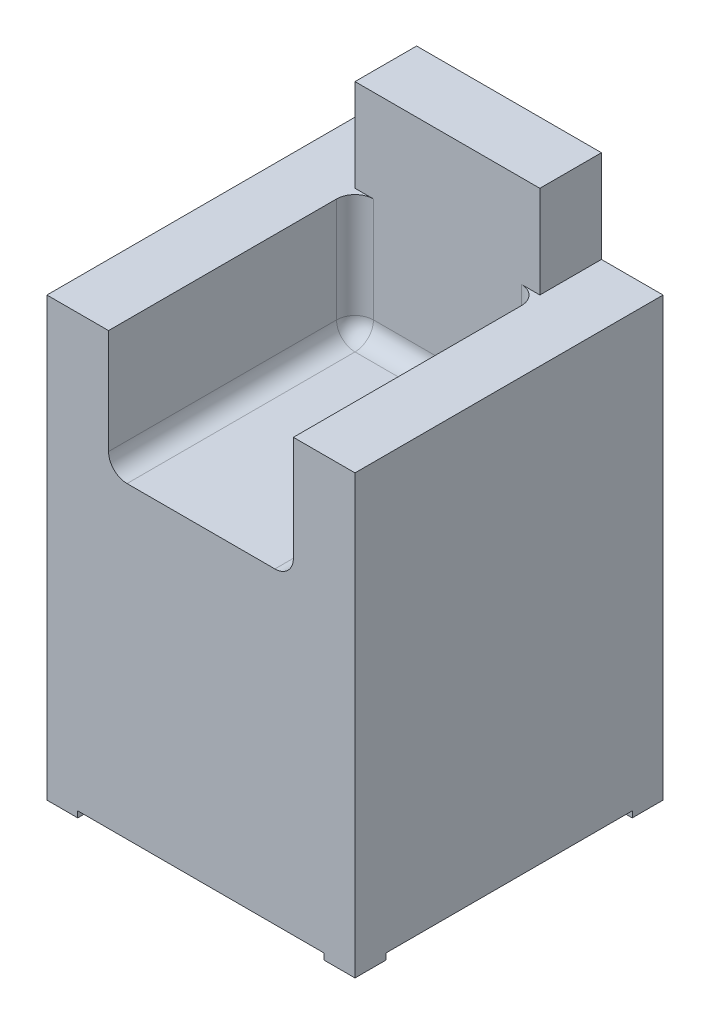
ISO-10303-21;
HEADER;
FILE_DESCRIPTION(('STEP AP214'),'2;1');
FILE_NAME('part.step','',(''),(''),'','','');
FILE_SCHEMA(('AUTOMOTIVE_DESIGN { 1 0 10303 214 1 1 1 1 }'));
ENDSEC;
DATA;
#1=APPLICATION_CONTEXT('core data for automotive mechanical design processes');
#2=APPLICATION_PROTOCOL_DEFINITION('international standard','automotive_design',2000,#1);
#3=PRODUCT_CONTEXT('',#1,'mechanical');
#4=PRODUCT('Part','Part','',(#3));
#5=PRODUCT_RELATED_PRODUCT_CATEGORY('part','',(#4));
#6=PRODUCT_DEFINITION_FORMATION('','',#4);
#7=PRODUCT_DEFINITION_CONTEXT('part definition',#1,'design');
#8=PRODUCT_DEFINITION('design','',#6,#7);
#9=PRODUCT_DEFINITION_SHAPE('','',#8);
#10=(LENGTH_UNIT() NAMED_UNIT(*) SI_UNIT(.MILLI.,.METRE.));
#11=(NAMED_UNIT(*) PLANE_ANGLE_UNIT() SI_UNIT($,.RADIAN.));
#12=(NAMED_UNIT(*) SI_UNIT($,.STERADIAN.) SOLID_ANGLE_UNIT());
#13=UNCERTAINTY_MEASURE_WITH_UNIT(LENGTH_MEASURE(1.E-05),#10,'distance_accuracy_value','');
#14=(GEOMETRIC_REPRESENTATION_CONTEXT(3) GLOBAL_UNCERTAINTY_ASSIGNED_CONTEXT((#13)) GLOBAL_UNIT_ASSIGNED_CONTEXT((#10,
#11,#12)) REPRESENTATION_CONTEXT('',''));
#15=CARTESIAN_POINT('',(0.,0.,0.));
#16=DIRECTION('',(0.,0.,1.));
#17=DIRECTION('',(1.,0.,0.));
#18=AXIS2_PLACEMENT_3D('',#15,#16,#17);
#19=CARTESIAN_POINT('',(0.,-250.,0.));
#20=DIRECTION('',(0.,1.,0.));
#21=DIRECTION('',(0.,0.,1.));
#22=AXIS2_PLACEMENT_3D('',#19,#20,#21);
#23=PLANE('',#22);
#24=DIRECTION('',(0.,0.,-1.));
#25=VECTOR('',#24,1.);
#26=CARTESIAN_POINT('',(-50.,-250.,50.));
#27=LINE('',#26,#25);
#28=CARTESIAN_POINT('',(-50.,-250.,50.));
#29=VERTEX_POINT('',#28);
#30=CARTESIAN_POINT('',(-50.,-250.,0.));
#31=VERTEX_POINT('',#30);
#32=EDGE_CURVE('E60',#29,#31,#27,.T.);
#33=ORIENTED_EDGE('',*,*,#32,.F.);
#34=DIRECTION('',(-1.,0.,0.));
#35=VECTOR('',#34,1.);
#36=CARTESIAN_POINT('',(0.,-250.,50.0000000000001));
#37=LINE('',#36,#35);
#38=CARTESIAN_POINT('',(0.,-250.,50.0000000000001));
#39=VERTEX_POINT('',#38);
#40=EDGE_CURVE('E233',#39,#29,#37,.T.);
#41=ORIENTED_EDGE('',*,*,#40,.F.);
#42=DIRECTION('',(0.,0.,-1.));
#43=VECTOR('',#42,1.);
#44=CARTESIAN_POINT('',(0.,-250.,500.));
#45=LINE('',#44,#43);
#46=CARTESIAN_POINT('',(0.,-250.,450.));
#47=VERTEX_POINT('',#46);
#48=EDGE_CURVE('E375',#47,#39,#45,.T.);
#49=ORIENTED_EDGE('',*,*,#48,.F.);
#50=DIRECTION('',(1.,0.,0.));
#51=VECTOR('',#50,1.);
#52=CARTESIAN_POINT('',(-50.,-250.,450.));
#53=LINE('',#52,#51);
#54=CARTESIAN_POINT('',(-50.,-250.,450.));
#55=VERTEX_POINT('',#54);
#56=EDGE_CURVE('E291',#55,#47,#53,.T.);
#57=ORIENTED_EDGE('',*,*,#56,.F.);
#58=DIRECTION('',(0.,0.,-1.));
#59=VECTOR('',#58,1.);
#60=CARTESIAN_POINT('',(-50.,-250.,500.));
#61=LINE('',#60,#59);
#62=CARTESIAN_POINT('',(-50.,-250.,500.));
#63=VERTEX_POINT('',#62);
#64=EDGE_CURVE('E289',#63,#55,#61,.T.);
#65=ORIENTED_EDGE('',*,*,#64,.F.);
#66=DIRECTION('',(1.,0.,0.));
#67=VECTOR('',#66,1.);
#68=CARTESIAN_POINT('',(-500.,-250.,500.));
#69=LINE('',#68,#67);
#70=CARTESIAN_POINT('',(-450.,-250.,500.));
#71=VERTEX_POINT('',#70);
#72=EDGE_CURVE('E380',#71,#63,#69,.T.);
#73=ORIENTED_EDGE('',*,*,#72,.F.);
#74=DIRECTION('',(0.,0.,1.));
#75=VECTOR('',#74,1.);
#76=CARTESIAN_POINT('',(-450.,-250.,450.));
#77=LINE('',#76,#75);
#78=CARTESIAN_POINT('',(-450.,-250.,450.));
#79=VERTEX_POINT('',#78);
#80=EDGE_CURVE('E295',#79,#71,#77,.T.);
#81=ORIENTED_EDGE('',*,*,#80,.F.);
#82=DIRECTION('',(1.,0.,0.));
#83=VECTOR('',#82,1.);
#84=CARTESIAN_POINT('',(-500.,-250.,450.));
#85=LINE('',#84,#83);
#86=CARTESIAN_POINT('',(-500.,-250.,450.));
#87=VERTEX_POINT('',#86);
#88=EDGE_CURVE('E308',#87,#79,#85,.T.);
#89=ORIENTED_EDGE('',*,*,#88,.F.);
#90=DIRECTION('',(0.,0.,1.));
#91=VECTOR('',#90,1.);
#92=CARTESIAN_POINT('',(-500.,-250.,0.));
#93=LINE('',#92,#91);
#94=CARTESIAN_POINT('',(-500.,-250.,50.0000000000001));
#95=VERTEX_POINT('',#94);
#96=EDGE_CURVE('E383',#95,#87,#93,.T.);
#97=ORIENTED_EDGE('',*,*,#96,.F.);
#98=DIRECTION('',(-1.,0.,0.));
#99=VECTOR('',#98,1.);
#100=CARTESIAN_POINT('',(-450.,-250.,50.0000000000001));
#101=LINE('',#100,#99);
#102=CARTESIAN_POINT('',(-450.,-250.,50.0000000000001));
#103=VERTEX_POINT('',#102);
#104=EDGE_CURVE('E68',#103,#95,#101,.T.);
#105=ORIENTED_EDGE('',*,*,#104,.F.);
#106=DIRECTION('',(0.,0.,1.));
#107=VECTOR('',#106,1.);
#108=CARTESIAN_POINT('',(-450.,-250.,0.));
#109=LINE('',#108,#107);
#110=CARTESIAN_POINT('',(-450.,-250.,0.));
#111=VERTEX_POINT('',#110);
#112=EDGE_CURVE('E269',#111,#103,#109,.T.);
#113=ORIENTED_EDGE('',*,*,#112,.F.);
#114=DIRECTION('',(-1.,0.,0.));
#115=VECTOR('',#114,1.);
#116=CARTESIAN_POINT('',(0.,-250.,0.));
#117=LINE('',#116,#115);
#118=EDGE_CURVE('E251',#31,#111,#117,.T.);
#119=ORIENTED_EDGE('',*,*,#118,.F.);
#120=EDGE_LOOP('',(#33,#41,#49,#57,#65,#73,#81,#89,#97,#105,#113,#119));
#121=FACE_BOUND('',#120,.T.);
#122=ADVANCED_FACE('F43',(#121),#23,.F.);
#123=CARTESIAN_POINT('',(0.,250.,0.));
#124=DIRECTION('',(0.,1.,0.));
#125=DIRECTION('',(0.,0.,1.));
#126=AXIS2_PLACEMENT_3D('',#123,#124,#125);
#127=PLANE('',#126);
#128=DIRECTION('',(0.,0.,1.));
#129=VECTOR('',#128,1.);
#130=CARTESIAN_POINT('',(-130.,250.,0.));
#131=LINE('',#130,#129);
#132=CARTESIAN_POINT('',(-130.,250.,500.));
#133=VERTEX_POINT('',#132);
#134=CARTESIAN_POINT('',(-130.,250.,130.));
#135=VERTEX_POINT('',#134);
#136=EDGE_CURVE('E411',#133,#135,#131,.F.);
#137=ORIENTED_EDGE('',*,*,#136,.T.);
#138=DIRECTION('',(1.,0.,0.));
#139=VECTOR('',#138,1.);
#140=CARTESIAN_POINT('',(0.,250.,130.));
#141=LINE('',#140,#139);
#142=CARTESIAN_POINT('',(-370.,250.,130.));
#143=VERTEX_POINT('',#142);
#144=EDGE_CURVE('E437',#135,#143,#141,.F.);
#145=ORIENTED_EDGE('',*,*,#144,.T.);
#146=DIRECTION('',(0.,0.,-1.));
#147=VECTOR('',#146,1.);
#148=CARTESIAN_POINT('',(-370.,250.,0.));
#149=LINE('',#148,#147);
#150=CARTESIAN_POINT('',(-370.,250.,500.));
#151=VERTEX_POINT('',#150);
#152=EDGE_CURVE('E405',#143,#151,#149,.F.);
#153=ORIENTED_EDGE('',*,*,#152,.T.);
#154=DIRECTION('',(1.,0.,0.));
#155=VECTOR('',#154,1.);
#156=CARTESIAN_POINT('',(-500.,250.,500.));
#157=LINE('',#156,#155);
#158=EDGE_CURVE('E376',#151,#133,#157,.T.);
#159=ORIENTED_EDGE('',*,*,#158,.T.);
#160=EDGE_LOOP('',(#137,#145,#153,#159));
#161=FACE_BOUND('',#160,.T.);
#162=ADVANCED_FACE('F523',(#161),#127,.T.);
#163=CARTESIAN_POINT('',(-500.,600.,100.));
#164=DIRECTION('',(0.,0.,-1.));
#165=DIRECTION('',(-1.,0.,0.));
#166=AXIS2_PLACEMENT_3D('',#163,#164,#165);
#167=PLANE('',#166);
#168=DIRECTION('',(0.,1.,0.));
#169=VECTOR('',#168,1.);
#170=CARTESIAN_POINT('',(-400.,600.,100.));
#171=LINE('',#170,#169);
#172=CARTESIAN_POINT('',(-400.,450.,100.));
#173=VERTEX_POINT('',#172);
#174=CARTESIAN_POINT('',(-400.,600.,100.));
#175=VERTEX_POINT('',#174);
#176=EDGE_CURVE('E338',#173,#175,#171,.T.);
#177=ORIENTED_EDGE('',*,*,#176,.F.);
#178=DIRECTION('',(1.,0.,0.));
#179=VECTOR('',#178,1.);
#180=CARTESIAN_POINT('',(-500.,450.,100.));
#181=LINE('',#180,#179);
#182=CARTESIAN_POINT('',(-370.,450.,100.));
#183=VERTEX_POINT('',#182);
#184=EDGE_CURVE('E426',#173,#183,#181,.T.);
#185=ORIENTED_EDGE('',*,*,#184,.T.);
#186=DIRECTION('',(0.,-1.,0.));
#187=VECTOR('',#186,1.);
#188=CARTESIAN_POINT('',(-370.,280.,100.));
#189=LINE('',#188,#187);
#190=CARTESIAN_POINT('',(-370.,280.,100.));
#191=VERTEX_POINT('',#190);
#192=EDGE_CURVE('E421',#183,#191,#189,.T.);
#193=ORIENTED_EDGE('',*,*,#192,.T.);
#194=DIRECTION('',(1.,0.,0.));
#195=VECTOR('',#194,1.);
#196=CARTESIAN_POINT('',(-500.,280.,100.));
#197=LINE('',#196,#195);
#198=CARTESIAN_POINT('',(-130.,280.,100.));
#199=VERTEX_POINT('',#198);
#200=EDGE_CURVE('E416',#191,#199,#197,.T.);
#201=ORIENTED_EDGE('',*,*,#200,.T.);
#202=DIRECTION('',(0.,-1.,0.));
#203=VECTOR('',#202,1.);
#204=CARTESIAN_POINT('',(-130.,450.,100.));
#205=LINE('',#204,#203);
#206=CARTESIAN_POINT('',(-130.,450.,100.));
#207=VERTEX_POINT('',#206);
#208=EDGE_CURVE('E418',#199,#207,#205,.F.);
#209=ORIENTED_EDGE('',*,*,#208,.T.);
#210=DIRECTION('',(1.,0.,0.));
#211=VECTOR('',#210,1.);
#212=CARTESIAN_POINT('',(-500.,450.,100.));
#213=LINE('',#212,#211);
#214=CARTESIAN_POINT('',(-100.,450.,100.));
#215=VERTEX_POINT('',#214);
#216=EDGE_CURVE('E424',#207,#215,#213,.T.);
#217=ORIENTED_EDGE('',*,*,#216,.T.);
#218=DIRECTION('',(0.,-1.,0.));
#219=VECTOR('',#218,1.);
#220=CARTESIAN_POINT('',(-100.,600.,100.));
#221=LINE('',#220,#219);
#222=CARTESIAN_POINT('',(-100.,600.,100.));
#223=VERTEX_POINT('',#222);
#224=EDGE_CURVE('E329',#223,#215,#221,.T.);
#225=ORIENTED_EDGE('',*,*,#224,.F.);
#226=DIRECTION('',(1.,0.,0.));
#227=VECTOR('',#226,1.);
#228=CARTESIAN_POINT('',(-500.,600.,100.));
#229=LINE('',#228,#227);
#230=EDGE_CURVE('E372',#175,#223,#229,.T.);
#231=ORIENTED_EDGE('',*,*,#230,.F.);
#232=EDGE_LOOP('',(#177,#185,#193,#201,#209,#217,#225,#231));
#233=FACE_BOUND('',#232,.T.);
#234=ADVANCED_FACE('F460',(#233),#167,.F.);
#235=CARTESIAN_POINT('',(0.,250.,500.));
#236=DIRECTION('',(-1.,0.,0.));
#237=DIRECTION('',(0.,0.,1.));
#238=AXIS2_PLACEMENT_3D('',#235,#236,#237);
#239=PLANE('',#238);
#240=DIRECTION('',(0.,-1.,0.));
#241=VECTOR('',#240,1.);
#242=CARTESIAN_POINT('',(0.,250.,0.));
#243=LINE('',#242,#241);
#244=CARTESIAN_POINT('',(0.,450.,0.));
#245=VERTEX_POINT('',#244);
#246=CARTESIAN_POINT('',(0.,-260.,0.));
#247=VERTEX_POINT('',#246);
#248=EDGE_CURVE('E392',#245,#247,#243,.T.);
#249=ORIENTED_EDGE('',*,*,#248,.F.);
#250=DIRECTION('',(0.,0.,-1.));
#251=VECTOR('',#250,1.);
#252=CARTESIAN_POINT('',(0.,450.,500.));
#253=LINE('',#252,#251);
#254=CARTESIAN_POINT('',(0.,450.,500.));
#255=VERTEX_POINT('',#254);
#256=EDGE_CURVE('E349',#255,#245,#253,.T.);
#257=ORIENTED_EDGE('',*,*,#256,.F.);
#258=DIRECTION('',(0.,-1.,0.));
#259=VECTOR('',#258,1.);
#260=CARTESIAN_POINT('',(0.,250.,500.));
#261=LINE('',#260,#259);
#262=CARTESIAN_POINT('',(0.,-260.,500.));
#263=VERTEX_POINT('',#262);
#264=EDGE_CURVE('E379',#255,#263,#261,.T.);
#265=ORIENTED_EDGE('',*,*,#264,.T.);
#266=DIRECTION('',(0.,0.,1.));
#267=VECTOR('',#266,1.);
#268=CARTESIAN_POINT('',(0.,-260.,450.));
#269=LINE('',#268,#267);
#270=CARTESIAN_POINT('',(0.,-260.,450.));
#271=VERTEX_POINT('',#270);
#272=EDGE_CURVE('E299',#271,#263,#269,.T.);
#273=ORIENTED_EDGE('',*,*,#272,.F.);
#274=DIRECTION('',(0.,1.,0.));
#275=VECTOR('',#274,1.);
#276=CARTESIAN_POINT('',(0.,-260.,450.));
#277=LINE('',#276,#275);
#278=EDGE_CURVE('E273',#271,#47,#277,.T.);
#279=ORIENTED_EDGE('',*,*,#278,.T.);
#280=ORIENTED_EDGE('',*,*,#48,.T.);
#281=DIRECTION('',(0.,1.,0.));
#282=VECTOR('',#281,1.);
#283=CARTESIAN_POINT('',(0.,-260.,50.0000000000001));
#284=LINE('',#283,#282);
#285=CARTESIAN_POINT('',(0.,-260.,50.0000000000001));
#286=VERTEX_POINT('',#285);
#287=EDGE_CURVE('E239',#286,#39,#284,.T.);
#288=ORIENTED_EDGE('',*,*,#287,.F.);
#289=DIRECTION('',(0.,0.,1.));
#290=VECTOR('',#289,1.);
#291=CARTESIAN_POINT('',(0.,-260.,0.));
#292=LINE('',#291,#290);
#293=EDGE_CURVE('E258',#247,#286,#292,.T.);
#294=ORIENTED_EDGE('',*,*,#293,.F.);
#295=EDGE_LOOP('',(#249,#257,#265,#273,#279,#280,#288,#294));
#296=FACE_BOUND('',#295,.T.);
#297=ADVANCED_FACE('F562',(#296),#239,.F.);
#298=CARTESIAN_POINT('',(0.,250.,0.));
#299=DIRECTION('',(0.,0.,1.));
#300=DIRECTION('',(1.,0.,0.));
#301=AXIS2_PLACEMENT_3D('',#298,#299,#300);
#302=PLANE('',#301);
#303=DIRECTION('',(-1.,0.,0.));
#304=VECTOR('',#303,1.);
#305=CARTESIAN_POINT('',(0.,600.,0.));
#306=LINE('',#305,#304);
#307=CARTESIAN_POINT('',(-100.,600.,0.));
#308=VERTEX_POINT('',#307);
#309=CARTESIAN_POINT('',(-400.,600.,0.));
#310=VERTEX_POINT('',#309);
#311=EDGE_CURVE('E370',#308,#310,#306,.T.);
#312=ORIENTED_EDGE('',*,*,#311,.F.);
#313=DIRECTION('',(0.,-1.,0.));
#314=VECTOR('',#313,1.);
#315=CARTESIAN_POINT('',(-100.,250.,0.));
#316=LINE('',#315,#314);
#317=CARTESIAN_POINT('',(-100.,450.,0.));
#318=VERTEX_POINT('',#317);
#319=EDGE_CURVE('E335',#308,#318,#316,.T.);
#320=ORIENTED_EDGE('',*,*,#319,.T.);
#321=DIRECTION('',(1.,0.,0.));
#322=VECTOR('',#321,1.);
#323=CARTESIAN_POINT('',(0.,450.,0.));
#324=LINE('',#323,#322);
#325=EDGE_CURVE('E399',#318,#245,#324,.T.);
#326=ORIENTED_EDGE('',*,*,#325,.T.);
#327=ORIENTED_EDGE('',*,*,#248,.T.);
#328=DIRECTION('',(1.,0.,0.));
#329=VECTOR('',#328,1.);
#330=CARTESIAN_POINT('',(-50.,-260.,0.));
#331=LINE('',#330,#329);
#332=CARTESIAN_POINT('',(-50.,-260.,0.));
#333=VERTEX_POINT('',#332);
#334=EDGE_CURVE('E260',#333,#247,#331,.T.);
#335=ORIENTED_EDGE('',*,*,#334,.F.);
#336=DIRECTION('',(0.,1.,0.));
#337=VECTOR('',#336,1.);
#338=CARTESIAN_POINT('',(-50.,-260.,0.));
#339=LINE('',#338,#337);
#340=EDGE_CURVE('E896',#333,#31,#339,.T.);
#341=ORIENTED_EDGE('',*,*,#340,.T.);
#342=ORIENTED_EDGE('',*,*,#118,.T.);
#343=DIRECTION('',(0.,1.,0.));
#344=VECTOR('',#343,1.);
#345=CARTESIAN_POINT('',(-450.,-260.,0.));
#346=LINE('',#345,#344);
#347=CARTESIAN_POINT('',(-450.,-260.,0.));
#348=VERTEX_POINT('',#347);
#349=EDGE_CURVE('E254',#348,#111,#346,.T.);
#350=ORIENTED_EDGE('',*,*,#349,.F.);
#351=DIRECTION('',(1.,0.,0.));
#352=VECTOR('',#351,1.);
#353=CARTESIAN_POINT('',(-500.,-260.,0.));
#354=LINE('',#353,#352);
#355=CARTESIAN_POINT('',(-500.,-260.,0.));
#356=VERTEX_POINT('',#355);
#357=EDGE_CURVE('E275',#356,#348,#354,.T.);
#358=ORIENTED_EDGE('',*,*,#357,.F.);
#359=DIRECTION('',(0.,-1.,0.));
#360=VECTOR('',#359,1.);
#361=CARTESIAN_POINT('',(-500.,250.,0.));
#362=LINE('',#361,#360);
#363=CARTESIAN_POINT('',(-500.,450.,0.));
#364=VERTEX_POINT('',#363);
#365=EDGE_CURVE('E390',#364,#356,#362,.T.);
#366=ORIENTED_EDGE('',*,*,#365,.F.);
#367=DIRECTION('',(1.,0.,0.));
#368=VECTOR('',#367,1.);
#369=CARTESIAN_POINT('',(0.,450.,0.));
#370=LINE('',#369,#368);
#371=CARTESIAN_POINT('',(-400.,450.,0.));
#372=VERTEX_POINT('',#371);
#373=EDGE_CURVE('E346',#364,#372,#370,.T.);
#374=ORIENTED_EDGE('',*,*,#373,.T.);
#375=DIRECTION('',(0.,1.,0.));
#376=VECTOR('',#375,1.);
#377=CARTESIAN_POINT('',(-400.,250.,0.));
#378=LINE('',#377,#376);
#379=EDGE_CURVE('E343',#372,#310,#378,.T.);
#380=ORIENTED_EDGE('',*,*,#379,.T.);
#381=EDGE_LOOP('',(#312,#320,#326,#327,#335,#341,#342,#350,#358,#366,#374,#380));
#382=FACE_BOUND('',#381,.T.);
#383=ADVANCED_FACE('F493',(#382),#302,.F.);
#384=CARTESIAN_POINT('',(-500.,250.,0.));
#385=DIRECTION('',(1.,0.,0.));
#386=DIRECTION('',(0.,0.,-1.));
#387=AXIS2_PLACEMENT_3D('',#384,#385,#386);
#388=PLANE('',#387);
#389=DIRECTION('',(0.,0.,1.));
#390=VECTOR('',#389,1.);
#391=CARTESIAN_POINT('',(-500.,450.,100.));
#392=LINE('',#391,#390);
#393=CARTESIAN_POINT('',(-500.,450.,500.));
#394=VERTEX_POINT('',#393);
#395=EDGE_CURVE('E359',#364,#394,#392,.T.);
#396=ORIENTED_EDGE('',*,*,#395,.F.);
#397=ORIENTED_EDGE('',*,*,#365,.T.);
#398=DIRECTION('',(0.,0.,-1.));
#399=VECTOR('',#398,1.);
#400=CARTESIAN_POINT('',(-500.,-260.,50.0000000000001));
#401=LINE('',#400,#399);
#402=CARTESIAN_POINT('',(-500.,-260.,50.0000000000001));
#403=VERTEX_POINT('',#402);
#404=EDGE_CURVE('E277',#403,#356,#401,.T.);
#405=ORIENTED_EDGE('',*,*,#404,.F.);
#406=DIRECTION('',(0.,1.,0.));
#407=VECTOR('',#406,1.);
#408=CARTESIAN_POINT('',(-500.,-260.,50.0000000000001));
#409=LINE('',#408,#407);
#410=EDGE_CURVE('E252',#403,#95,#409,.T.);
#411=ORIENTED_EDGE('',*,*,#410,.T.);
#412=ORIENTED_EDGE('',*,*,#96,.T.);
#413=DIRECTION('',(0.,1.,0.));
#414=VECTOR('',#413,1.);
#415=CARTESIAN_POINT('',(-500.,-260.,450.));
#416=LINE('',#415,#414);
#417=CARTESIAN_POINT('',(-500.,-260.,450.));
#418=VERTEX_POINT('',#417);
#419=EDGE_CURVE('E322',#418,#87,#416,.T.);
#420=ORIENTED_EDGE('',*,*,#419,.F.);
#421=DIRECTION('',(0.,0.,-1.));
#422=VECTOR('',#421,1.);
#423=CARTESIAN_POINT('',(-500.,-260.,500.));
#424=LINE('',#423,#422);
#425=CARTESIAN_POINT('',(-500.,-260.,500.));
#426=VERTEX_POINT('',#425);
#427=EDGE_CURVE('E311',#426,#418,#424,.T.);
#428=ORIENTED_EDGE('',*,*,#427,.F.);
#429=DIRECTION('',(0.,-1.,0.));
#430=VECTOR('',#429,1.);
#431=CARTESIAN_POINT('',(-500.,250.,500.));
#432=LINE('',#431,#430);
#433=EDGE_CURVE('E388',#394,#426,#432,.T.);
#434=ORIENTED_EDGE('',*,*,#433,.F.);
#435=EDGE_LOOP('',(#396,#397,#405,#411,#412,#420,#428,#434));
#436=FACE_BOUND('',#435,.T.);
#437=ADVANCED_FACE('F497',(#436),#388,.F.);
#438=CARTESIAN_POINT('',(-500.,250.,500.));
#439=DIRECTION('',(0.,0.,-1.));
#440=DIRECTION('',(-1.,0.,0.));
#441=AXIS2_PLACEMENT_3D('',#438,#439,#440);
#442=PLANE('',#441);
#443=ORIENTED_EDGE('',*,*,#433,.T.);
#444=DIRECTION('',(-1.,0.,0.));
#445=VECTOR('',#444,1.);
#446=CARTESIAN_POINT('',(-450.,-260.,500.));
#447=LINE('',#446,#445);
#448=CARTESIAN_POINT('',(-450.,-260.,500.));
#449=VERTEX_POINT('',#448);
#450=EDGE_CURVE('E307',#449,#426,#447,.T.);
#451=ORIENTED_EDGE('',*,*,#450,.F.);
#452=DIRECTION('',(0.,1.,0.));
#453=VECTOR('',#452,1.);
#454=CARTESIAN_POINT('',(-450.,-260.,500.));
#455=LINE('',#454,#453);
#456=EDGE_CURVE('E325',#449,#71,#455,.T.);
#457=ORIENTED_EDGE('',*,*,#456,.T.);
#458=ORIENTED_EDGE('',*,*,#72,.T.);
#459=DIRECTION('',(0.,1.,0.));
#460=VECTOR('',#459,1.);
#461=CARTESIAN_POINT('',(-50.,-260.,500.));
#462=LINE('',#461,#460);
#463=CARTESIAN_POINT('',(-50.,-260.,500.));
#464=VERTEX_POINT('',#463);
#465=EDGE_CURVE('E283',#464,#63,#462,.T.);
#466=ORIENTED_EDGE('',*,*,#465,.F.);
#467=DIRECTION('',(-1.,0.,0.));
#468=VECTOR('',#467,1.);
#469=CARTESIAN_POINT('',(0.,-260.,500.));
#470=LINE('',#469,#468);
#471=EDGE_CURVE('E297',#263,#464,#470,.T.);
#472=ORIENTED_EDGE('',*,*,#471,.F.);
#473=ORIENTED_EDGE('',*,*,#264,.F.);
#474=DIRECTION('',(1.,0.,0.));
#475=VECTOR('',#474,1.);
#476=CARTESIAN_POINT('',(-100.,450.,500.));
#477=LINE('',#476,#475);
#478=CARTESIAN_POINT('',(-100.,450.,500.));
#479=VERTEX_POINT('',#478);
#480=EDGE_CURVE('E353',#479,#255,#477,.T.);
#481=ORIENTED_EDGE('',*,*,#480,.F.);
#482=DIRECTION('',(0.,-1.,0.));
#483=VECTOR('',#482,1.);
#484=CARTESIAN_POINT('',(-100.,450.,500.));
#485=LINE('',#484,#483);
#486=CARTESIAN_POINT('',(-100.,280.,500.));
#487=VERTEX_POINT('',#486);
#488=EDGE_CURVE('E356',#479,#487,#485,.T.);
#489=ORIENTED_EDGE('',*,*,#488,.T.);
#490=CARTESIAN_POINT('',(-130.,280.,500.));
#491=DIRECTION('',(0.,0.,-1.));
#492=DIRECTION('',(-1.,0.,0.));
#493=AXIS2_PLACEMENT_3D('',#490,#491,#492);
#494=CIRCLE('',#493,30.);
#495=EDGE_CURVE('E414',#487,#133,#494,.T.);
#496=ORIENTED_EDGE('',*,*,#495,.T.);
#497=ORIENTED_EDGE('',*,*,#158,.F.);
#498=CARTESIAN_POINT('',(-370.,280.,500.));
#499=DIRECTION('',(0.,0.,-1.));
#500=DIRECTION('',(-1.,0.,0.));
#501=AXIS2_PLACEMENT_3D('',#498,#499,#500);
#502=CIRCLE('',#501,30.);
#503=CARTESIAN_POINT('',(-400.,280.,500.));
#504=VERTEX_POINT('',#503);
#505=EDGE_CURVE('E407',#151,#504,#502,.T.);
#506=ORIENTED_EDGE('',*,*,#505,.T.);
#507=DIRECTION('',(0.,-1.,0.));
#508=VECTOR('',#507,1.);
#509=CARTESIAN_POINT('',(-400.,450.,500.));
#510=LINE('',#509,#508);
#511=CARTESIAN_POINT('',(-400.,450.,500.));
#512=VERTEX_POINT('',#511);
#513=EDGE_CURVE('E367',#512,#504,#510,.T.);
#514=ORIENTED_EDGE('',*,*,#513,.F.);
#515=DIRECTION('',(1.,0.,0.));
#516=VECTOR('',#515,1.);
#517=CARTESIAN_POINT('',(-500.,450.,500.));
#518=LINE('',#517,#516);
#519=EDGE_CURVE('E362',#394,#512,#518,.T.);
#520=ORIENTED_EDGE('',*,*,#519,.F.);
#521=EDGE_LOOP('',(#443,#451,#457,#458,#466,#472,#473,#481,#489,#496,#497,#506,#514,#520));
#522=FACE_BOUND('',#521,.T.);
#523=ADVANCED_FACE('F517',(#522),#442,.F.);
#524=CARTESIAN_POINT('',(0.,600.,0.));
#525=DIRECTION('',(0.,1.,0.));
#526=DIRECTION('',(0.,0.,1.));
#527=AXIS2_PLACEMENT_3D('',#524,#525,#526);
#528=PLANE('',#527);
#529=DIRECTION('',(0.,0.,1.));
#530=VECTOR('',#529,1.);
#531=CARTESIAN_POINT('',(-100.,600.,0.));
#532=LINE('',#531,#530);
#533=EDGE_CURVE('E397',#308,#223,#532,.T.);
#534=ORIENTED_EDGE('',*,*,#533,.F.);
#535=ORIENTED_EDGE('',*,*,#311,.T.);
#536=DIRECTION('',(0.,0.,-1.));
#537=VECTOR('',#536,1.);
#538=CARTESIAN_POINT('',(-400.,600.,0.));
#539=LINE('',#538,#537);
#540=EDGE_CURVE('E394',#175,#310,#539,.T.);
#541=ORIENTED_EDGE('',*,*,#540,.F.);
#542=ORIENTED_EDGE('',*,*,#230,.T.);
#543=EDGE_LOOP('',(#534,#535,#541,#542));
#544=FACE_BOUND('',#543,.T.);
#545=ADVANCED_FACE('F541',(#544),#528,.T.);
#546=CARTESIAN_POINT('',(-400.,450.,500.));
#547=DIRECTION('',(-1.,0.,0.));
#548=DIRECTION('',(0.,0.,1.));
#549=AXIS2_PLACEMENT_3D('',#546,#547,#548);
#550=PLANE('',#549);
#551=DIRECTION('',(0.,0.,-1.));
#552=VECTOR('',#551,1.);
#553=CARTESIAN_POINT('',(-400.,280.,500.));
#554=LINE('',#553,#552);
#555=CARTESIAN_POINT('',(-400.,280.,130.));
#556=VERTEX_POINT('',#555);
#557=EDGE_CURVE('E402',#504,#556,#554,.T.);
#558=ORIENTED_EDGE('',*,*,#557,.T.);
#559=DIRECTION('',(0.,-1.,0.));
#560=VECTOR('',#559,1.);
#561=CARTESIAN_POINT('',(-400.,450.,130.));
#562=LINE('',#561,#560);
#563=CARTESIAN_POINT('',(-400.,450.,130.));
#564=VERTEX_POINT('',#563);
#565=EDGE_CURVE('E429',#556,#564,#562,.F.);
#566=ORIENTED_EDGE('',*,*,#565,.T.);
#567=DIRECTION('',(0.,0.,-1.));
#568=VECTOR('',#567,1.);
#569=CARTESIAN_POINT('',(-400.,450.,500.));
#570=LINE('',#569,#568);
#571=EDGE_CURVE('E364',#512,#564,#570,.T.);
#572=ORIENTED_EDGE('',*,*,#571,.F.);
#573=ORIENTED_EDGE('',*,*,#513,.T.);
#574=EDGE_LOOP('',(#558,#566,#572,#573));
#575=FACE_BOUND('',#574,.T.);
#576=ADVANCED_FACE('F476',(#575),#550,.F.);
#577=CARTESIAN_POINT('',(0.,450.,0.));
#578=DIRECTION('',(0.,1.,0.));
#579=DIRECTION('',(0.,0.,1.));
#580=AXIS2_PLACEMENT_3D('',#577,#578,#579);
#581=PLANE('',#580);
#582=ORIENTED_EDGE('',*,*,#571,.T.);
#583=CARTESIAN_POINT('',(-370.,450.,130.));
#584=DIRECTION('',(0.,1.,0.));
#585=DIRECTION('',(0.,0.,1.));
#586=AXIS2_PLACEMENT_3D('',#583,#584,#585);
#587=CIRCLE('',#586,30.);
#588=EDGE_CURVE('E52',#564,#183,#587,.F.);
#589=ORIENTED_EDGE('',*,*,#588,.T.);
#590=ORIENTED_EDGE('',*,*,#184,.F.);
#591=DIRECTION('',(0.,0.,1.));
#592=VECTOR('',#591,1.);
#593=CARTESIAN_POINT('',(-400.,450.,-99.9999999999999));
#594=LINE('',#593,#592);
#595=EDGE_CURVE('E340',#372,#173,#594,.T.);
#596=ORIENTED_EDGE('',*,*,#595,.F.);
#597=ORIENTED_EDGE('',*,*,#373,.F.);
#598=ORIENTED_EDGE('',*,*,#395,.T.);
#599=ORIENTED_EDGE('',*,*,#519,.T.);
#600=EDGE_LOOP('',(#582,#589,#590,#596,#597,#598,#599));
#601=FACE_BOUND('',#600,.T.);
#602=ADVANCED_FACE('F483',(#601),#581,.T.);
#603=CARTESIAN_POINT('',(-100.,450.,100.));
#604=DIRECTION('',(1.,0.,0.));
#605=DIRECTION('',(0.,0.,-1.));
#606=AXIS2_PLACEMENT_3D('',#603,#604,#605);
#607=PLANE('',#606);
#608=DIRECTION('',(0.,0.,1.));
#609=VECTOR('',#608,1.);
#610=CARTESIAN_POINT('',(-100.,450.,100.));
#611=LINE('',#610,#609);
#612=CARTESIAN_POINT('',(-100.,450.,130.));
#613=VERTEX_POINT('',#612);
#614=EDGE_CURVE('E351',#613,#479,#611,.T.);
#615=ORIENTED_EDGE('',*,*,#614,.F.);
#616=DIRECTION('',(0.,-1.,0.));
#617=VECTOR('',#616,1.);
#618=CARTESIAN_POINT('',(-100.,280.,130.));
#619=LINE('',#618,#617);
#620=CARTESIAN_POINT('',(-100.,280.,130.));
#621=VERTEX_POINT('',#620);
#622=EDGE_CURVE('E433',#613,#621,#619,.T.);
#623=ORIENTED_EDGE('',*,*,#622,.T.);
#624=DIRECTION('',(0.,0.,1.));
#625=VECTOR('',#624,1.);
#626=CARTESIAN_POINT('',(-100.,280.,100.));
#627=LINE('',#626,#625);
#628=EDGE_CURVE('E409',#621,#487,#627,.T.);
#629=ORIENTED_EDGE('',*,*,#628,.T.);
#630=ORIENTED_EDGE('',*,*,#488,.F.);
#631=EDGE_LOOP('',(#615,#623,#629,#630));
#632=FACE_BOUND('',#631,.T.);
#633=ADVANCED_FACE('F530',(#632),#607,.F.);
#634=CARTESIAN_POINT('',(0.,450.,0.));
#635=DIRECTION('',(0.,1.,0.));
#636=DIRECTION('',(0.,0.,1.));
#637=AXIS2_PLACEMENT_3D('',#634,#635,#636);
#638=PLANE('',#637);
#639=ORIENTED_EDGE('',*,*,#256,.T.);
#640=ORIENTED_EDGE('',*,*,#325,.F.);
#641=DIRECTION('',(0.,0.,1.));
#642=VECTOR('',#641,1.);
#643=CARTESIAN_POINT('',(-100.,450.,-99.9999999999999));
#644=LINE('',#643,#642);
#645=EDGE_CURVE('E332',#318,#215,#644,.T.);
#646=ORIENTED_EDGE('',*,*,#645,.T.);
#647=ORIENTED_EDGE('',*,*,#216,.F.);
#648=CARTESIAN_POINT('',(-130.,450.,130.));
#649=DIRECTION('',(0.,1.,0.));
#650=DIRECTION('',(0.,0.,1.));
#651=AXIS2_PLACEMENT_3D('',#648,#649,#650);
#652=CIRCLE('',#651,30.);
#653=EDGE_CURVE('E11',#207,#613,#652,.F.);
#654=ORIENTED_EDGE('',*,*,#653,.T.);
#655=ORIENTED_EDGE('',*,*,#614,.T.);
#656=ORIENTED_EDGE('',*,*,#480,.T.);
#657=EDGE_LOOP('',(#639,#640,#646,#647,#654,#655,#656));
#658=FACE_BOUND('',#657,.T.);
#659=ADVANCED_FACE('F533',(#658),#638,.T.);
#660=CARTESIAN_POINT('',(-400.,600.,-99.9999999999999));
#661=DIRECTION('',(1.,0.,0.));
#662=DIRECTION('',(0.,0.,-1.));
#663=AXIS2_PLACEMENT_3D('',#660,#661,#662);
#664=PLANE('',#663);
#665=ORIENTED_EDGE('',*,*,#595,.T.);
#666=ORIENTED_EDGE('',*,*,#176,.T.);
#667=ORIENTED_EDGE('',*,*,#540,.T.);
#668=ORIENTED_EDGE('',*,*,#379,.F.);
#669=EDGE_LOOP('',(#665,#666,#667,#668));
#670=FACE_BOUND('',#669,.T.);
#671=ADVANCED_FACE('F488',(#670),#664,.F.);
#672=CARTESIAN_POINT('',(-100.,600.,-99.9999999999999));
#673=DIRECTION('',(-1.,0.,0.));
#674=DIRECTION('',(0.,-1.,0.));
#675=AXIS2_PLACEMENT_3D('',#672,#673,#674);
#676=PLANE('',#675);
#677=ORIENTED_EDGE('',*,*,#533,.T.);
#678=ORIENTED_EDGE('',*,*,#224,.T.);
#679=ORIENTED_EDGE('',*,*,#645,.F.);
#680=ORIENTED_EDGE('',*,*,#319,.F.);
#681=EDGE_LOOP('',(#677,#678,#679,#680));
#682=FACE_BOUND('',#681,.T.);
#683=ADVANCED_FACE('F537',(#682),#676,.F.);
#684=CARTESIAN_POINT('',(-370.,280.,500.));
#685=DIRECTION('',(0.,0.,-1.));
#686=DIRECTION('',(-1.,0.,0.));
#687=AXIS2_PLACEMENT_3D('',#684,#685,#686);
#688=CYLINDRICAL_SURFACE('',#687,30.);
#689=ORIENTED_EDGE('',*,*,#152,.F.);
#690=CARTESIAN_POINT('',(-370.,280.,130.));
#691=DIRECTION('',(0.,0.,-1.));
#692=DIRECTION('',(-1.,0.,0.));
#693=AXIS2_PLACEMENT_3D('',#690,#691,#692);
#694=CIRCLE('',#693,30.);
#695=EDGE_CURVE('E431',#143,#556,#694,.T.);
#696=ORIENTED_EDGE('',*,*,#695,.T.);
#697=ORIENTED_EDGE('',*,*,#557,.F.);
#698=ORIENTED_EDGE('',*,*,#505,.F.);
#699=EDGE_LOOP('',(#689,#696,#697,#698));
#700=FACE_BOUND('',#699,.T.);
#701=ADVANCED_FACE('F472',(#700),#688,.F.);
#702=CARTESIAN_POINT('',(-130.,280.,100.));
#703=DIRECTION('',(0.,0.,1.));
#704=DIRECTION('',(1.,0.,0.));
#705=AXIS2_PLACEMENT_3D('',#702,#703,#704);
#706=CYLINDRICAL_SURFACE('',#705,30.);
#707=ORIENTED_EDGE('',*,*,#628,.F.);
#708=CARTESIAN_POINT('',(-130.,280.,130.));
#709=DIRECTION('',(0.,0.,1.));
#710=DIRECTION('',(1.,0.,0.));
#711=AXIS2_PLACEMENT_3D('',#708,#709,#710);
#712=CIRCLE('',#711,30.);
#713=EDGE_CURVE('E435',#621,#135,#712,.F.);
#714=ORIENTED_EDGE('',*,*,#713,.T.);
#715=ORIENTED_EDGE('',*,*,#136,.F.);
#716=ORIENTED_EDGE('',*,*,#495,.F.);
#717=EDGE_LOOP('',(#707,#714,#715,#716));
#718=FACE_BOUND('',#717,.T.);
#719=ADVANCED_FACE('F526',(#718),#706,.F.);
#720=CARTESIAN_POINT('',(-130.,450.,130.));
#721=DIRECTION('',(0.,1.,0.));
#722=DIRECTION('',(0.,0.,1.));
#723=AXIS2_PLACEMENT_3D('',#720,#721,#722);
#724=CYLINDRICAL_SURFACE('',#723,30.);
#725=CARTESIAN_POINT('',(-130.,280.,130.));
#726=DIRECTION('',(0.,1.,0.));
#727=DIRECTION('',(0.,0.,1.));
#728=AXIS2_PLACEMENT_3D('',#725,#726,#727);
#729=CIRCLE('',#728,30.);
#730=EDGE_CURVE('E47',#621,#199,#729,.T.);
#731=ORIENTED_EDGE('',*,*,#730,.F.);
#732=ORIENTED_EDGE('',*,*,#622,.F.);
#733=ORIENTED_EDGE('',*,*,#653,.F.);
#734=ORIENTED_EDGE('',*,*,#208,.F.);
#735=EDGE_LOOP('',(#731,#732,#733,#734));
#736=FACE_BOUND('',#735,.T.);
#737=ADVANCED_FACE('F45',(#736),#724,.F.);
#738=CARTESIAN_POINT('',(-130.,280.,130.));
#739=DIRECTION('',(0.,0.,-1.));
#740=DIRECTION('',(-1.,0.,0.));
#741=AXIS2_PLACEMENT_3D('',#738,#739,#740);
#742=SPHERICAL_SURFACE('',#741,30.);
#743=ORIENTED_EDGE('',*,*,#713,.F.);
#744=ORIENTED_EDGE('',*,*,#730,.T.);
#745=CARTESIAN_POINT('',(-130.,280.,130.));
#746=DIRECTION('',(1.,0.,0.));
#747=DIRECTION('',(0.,0.,-1.));
#748=AXIS2_PLACEMENT_3D('',#745,#746,#747);
#749=CIRCLE('',#748,30.);
#750=EDGE_CURVE('E443',#135,#199,#749,.T.);
#751=ORIENTED_EDGE('',*,*,#750,.F.);
#752=EDGE_LOOP('',(#743,#744,#751));
#753=FACE_BOUND('',#752,.T.);
#754=ADVANCED_FACE('F453',(#753),#742,.F.);
#755=CARTESIAN_POINT('',(-500.,280.,130.));
#756=DIRECTION('',(1.,0.,0.));
#757=DIRECTION('',(0.,0.,-1.));
#758=AXIS2_PLACEMENT_3D('',#755,#756,#757);
#759=CYLINDRICAL_SURFACE('',#758,30.);
#760=CARTESIAN_POINT('',(-370.,280.,130.));
#761=DIRECTION('',(1.,0.,0.));
#762=DIRECTION('',(0.,0.,-1.));
#763=AXIS2_PLACEMENT_3D('',#760,#761,#762);
#764=CIRCLE('',#763,30.);
#765=EDGE_CURVE('E441',#143,#191,#764,.T.);
#766=ORIENTED_EDGE('',*,*,#765,.F.);
#767=ORIENTED_EDGE('',*,*,#144,.F.);
#768=ORIENTED_EDGE('',*,*,#750,.T.);
#769=ORIENTED_EDGE('',*,*,#200,.F.);
#770=EDGE_LOOP('',(#766,#767,#768,#769));
#771=FACE_BOUND('',#770,.T.);
#772=ADVANCED_FACE('F464',(#771),#759,.F.);
#773=CARTESIAN_POINT('',(-370.,280.,130.));
#774=DIRECTION('',(0.,0.,-1.));
#775=DIRECTION('',(-1.,0.,0.));
#776=AXIS2_PLACEMENT_3D('',#773,#774,#775);
#777=SPHERICAL_SURFACE('',#776,30.);
#778=ORIENTED_EDGE('',*,*,#695,.F.);
#779=ORIENTED_EDGE('',*,*,#765,.T.);
#780=CARTESIAN_POINT('',(-370.,280.,130.));
#781=DIRECTION('',(0.,-1.,0.));
#782=DIRECTION('',(0.,0.,-1.));
#783=AXIS2_PLACEMENT_3D('',#780,#781,#782);
#784=CIRCLE('',#783,30.);
#785=EDGE_CURVE('E328',#556,#191,#784,.T.);
#786=ORIENTED_EDGE('',*,*,#785,.F.);
#787=EDGE_LOOP('',(#778,#779,#786));
#788=FACE_BOUND('',#787,.T.);
#789=ADVANCED_FACE('F468',(#788),#777,.F.);
#790=CARTESIAN_POINT('',(-370.,600.,130.));
#791=DIRECTION('',(0.,1.,0.));
#792=DIRECTION('',(0.,0.,1.));
#793=AXIS2_PLACEMENT_3D('',#790,#791,#792);
#794=CYLINDRICAL_SURFACE('',#793,30.);
#795=ORIENTED_EDGE('',*,*,#588,.F.);
#796=ORIENTED_EDGE('',*,*,#565,.F.);
#797=ORIENTED_EDGE('',*,*,#785,.T.);
#798=ORIENTED_EDGE('',*,*,#192,.F.);
#799=EDGE_LOOP('',(#795,#796,#797,#798));
#800=FACE_BOUND('',#799,.T.);
#801=ADVANCED_FACE('F481',(#800),#794,.F.);
#802=CARTESIAN_POINT('',(-450.,-260.,450.));
#803=DIRECTION('',(-1.,0.,0.));
#804=DIRECTION('',(0.,0.,1.));
#805=AXIS2_PLACEMENT_3D('',#802,#803,#804);
#806=PLANE('',#805);
#807=ORIENTED_EDGE('',*,*,#80,.T.);
#808=ORIENTED_EDGE('',*,*,#456,.F.);
#809=DIRECTION('',(0.,0.,1.));
#810=VECTOR('',#809,1.);
#811=CARTESIAN_POINT('',(-450.,-260.,450.));
#812=LINE('',#811,#810);
#813=CARTESIAN_POINT('',(-450.,-260.,450.));
#814=VERTEX_POINT('',#813);
#815=EDGE_CURVE('E304',#814,#449,#812,.T.);
#816=ORIENTED_EDGE('',*,*,#815,.F.);
#817=DIRECTION('',(0.,1.,0.));
#818=VECTOR('',#817,1.);
#819=CARTESIAN_POINT('',(-450.,-260.,450.));
#820=LINE('',#819,#818);
#821=EDGE_CURVE('E315',#814,#79,#820,.T.);
#822=ORIENTED_EDGE('',*,*,#821,.T.);
#823=EDGE_LOOP('',(#807,#808,#816,#822));
#824=FACE_BOUND('',#823,.T.);
#825=ADVANCED_FACE('F572',(#824),#806,.F.);
#826=CARTESIAN_POINT('',(-500.,-260.,450.));
#827=DIRECTION('',(0.,0.,1.));
#828=DIRECTION('',(1.,0.,0.));
#829=AXIS2_PLACEMENT_3D('',#826,#827,#828);
#830=PLANE('',#829);
#831=ORIENTED_EDGE('',*,*,#88,.T.);
#832=ORIENTED_EDGE('',*,*,#821,.F.);
#833=DIRECTION('',(1.,0.,0.));
#834=VECTOR('',#833,1.);
#835=CARTESIAN_POINT('',(-500.,-260.,450.));
#836=LINE('',#835,#834);
#837=EDGE_CURVE('E313',#418,#814,#836,.T.);
#838=ORIENTED_EDGE('',*,*,#837,.F.);
#839=ORIENTED_EDGE('',*,*,#419,.T.);
#840=EDGE_LOOP('',(#831,#832,#838,#839));
#841=FACE_BOUND('',#840,.T.);
#842=ADVANCED_FACE('F510',(#841),#830,.F.);
#843=CARTESIAN_POINT('',(0.,-260.,0.));
#844=DIRECTION('',(0.,-1.,0.));
#845=DIRECTION('',(0.,0.,-1.));
#846=AXIS2_PLACEMENT_3D('',#843,#844,#845);
#847=PLANE('',#846);
#848=ORIENTED_EDGE('',*,*,#815,.T.);
#849=ORIENTED_EDGE('',*,*,#450,.T.);
#850=ORIENTED_EDGE('',*,*,#427,.T.);
#851=ORIENTED_EDGE('',*,*,#837,.T.);
#852=EDGE_LOOP('',(#848,#849,#850,#851));
#853=FACE_BOUND('',#852,.T.);
#854=ADVANCED_FACE('F513',(#853),#847,.T.);
#855=CARTESIAN_POINT('',(-50.,-260.,450.));
#856=DIRECTION('',(0.,0.,1.));
#857=DIRECTION('',(1.,0.,0.));
#858=AXIS2_PLACEMENT_3D('',#855,#856,#857);
#859=PLANE('',#858);
#860=ORIENTED_EDGE('',*,*,#56,.T.);
#861=ORIENTED_EDGE('',*,*,#278,.F.);
#862=DIRECTION('',(1.,0.,0.));
#863=VECTOR('',#862,1.);
#864=CARTESIAN_POINT('',(-50.,-260.,450.));
#865=LINE('',#864,#863);
#866=CARTESIAN_POINT('',(-50.,-260.,450.));
#867=VERTEX_POINT('',#866);
#868=EDGE_CURVE('E292',#867,#271,#865,.T.);
#869=ORIENTED_EDGE('',*,*,#868,.F.);
#870=DIRECTION('',(0.,1.,0.));
#871=VECTOR('',#870,1.);
#872=CARTESIAN_POINT('',(-50.,-260.,450.));
#873=LINE('',#872,#871);
#874=EDGE_CURVE('E285',#867,#55,#873,.T.);
#875=ORIENTED_EDGE('',*,*,#874,.T.);
#876=EDGE_LOOP('',(#860,#861,#869,#875));
#877=FACE_BOUND('',#876,.T.);
#878=ADVANCED_FACE('F674',(#877),#859,.F.);
#879=CARTESIAN_POINT('',(-50.,-260.,500.));
#880=DIRECTION('',(1.,0.,0.));
#881=DIRECTION('',(0.,0.,-1.));
#882=AXIS2_PLACEMENT_3D('',#879,#880,#881);
#883=PLANE('',#882);
#884=ORIENTED_EDGE('',*,*,#64,.T.);
#885=ORIENTED_EDGE('',*,*,#874,.F.);
#886=DIRECTION('',(0.,0.,-1.));
#887=VECTOR('',#886,1.);
#888=CARTESIAN_POINT('',(-50.,-260.,500.));
#889=LINE('',#888,#887);
#890=EDGE_CURVE('E288',#464,#867,#889,.T.);
#891=ORIENTED_EDGE('',*,*,#890,.F.);
#892=ORIENTED_EDGE('',*,*,#465,.T.);
#893=EDGE_LOOP('',(#884,#885,#891,#892));
#894=FACE_BOUND('',#893,.T.);
#895=ADVANCED_FACE('F662',(#894),#883,.F.);
#896=CARTESIAN_POINT('',(0.,-260.,0.));
#897=DIRECTION('',(0.,-1.,0.));
#898=DIRECTION('',(0.,0.,-1.));
#899=AXIS2_PLACEMENT_3D('',#896,#897,#898);
#900=PLANE('',#899);
#901=ORIENTED_EDGE('',*,*,#868,.T.);
#902=ORIENTED_EDGE('',*,*,#272,.T.);
#903=ORIENTED_EDGE('',*,*,#471,.T.);
#904=ORIENTED_EDGE('',*,*,#890,.T.);
#905=EDGE_LOOP('',(#901,#902,#903,#904));
#906=FACE_BOUND('',#905,.T.);
#907=ADVANCED_FACE('F658',(#906),#900,.T.);
#908=CARTESIAN_POINT('',(-450.,-260.,50.0000000000001));
#909=DIRECTION('',(0.,0.,-1.));
#910=DIRECTION('',(-1.,0.,0.));
#911=AXIS2_PLACEMENT_3D('',#908,#909,#910);
#912=PLANE('',#911);
#913=ORIENTED_EDGE('',*,*,#104,.T.);
#914=ORIENTED_EDGE('',*,*,#410,.F.);
#915=DIRECTION('',(-1.,0.,0.));
#916=VECTOR('',#915,1.);
#917=CARTESIAN_POINT('',(-450.,-260.,50.0000000000001));
#918=LINE('',#917,#916);
#919=CARTESIAN_POINT('',(-450.,-260.,50.0000000000001));
#920=VERTEX_POINT('',#919);
#921=EDGE_CURVE('E271',#920,#403,#918,.T.);
#922=ORIENTED_EDGE('',*,*,#921,.F.);
#923=DIRECTION('',(0.,1.,0.));
#924=VECTOR('',#923,1.);
#925=CARTESIAN_POINT('',(-450.,-260.,50.0000000000001));
#926=LINE('',#925,#924);
#927=EDGE_CURVE('E266',#920,#103,#926,.T.);
#928=ORIENTED_EDGE('',*,*,#927,.T.);
#929=EDGE_LOOP('',(#913,#914,#922,#928));
#930=FACE_BOUND('',#929,.T.);
#931=ADVANCED_FACE('F503',(#930),#912,.F.);
#932=CARTESIAN_POINT('',(-450.,-260.,0.));
#933=DIRECTION('',(-1.,0.,0.));
#934=DIRECTION('',(0.,0.,1.));
#935=AXIS2_PLACEMENT_3D('',#932,#933,#934);
#936=PLANE('',#935);
#937=ORIENTED_EDGE('',*,*,#112,.T.);
#938=ORIENTED_EDGE('',*,*,#927,.F.);
#939=DIRECTION('',(0.,0.,1.));
#940=VECTOR('',#939,1.);
#941=CARTESIAN_POINT('',(-450.,-260.,0.));
#942=LINE('',#941,#940);
#943=EDGE_CURVE('E268',#348,#920,#942,.T.);
#944=ORIENTED_EDGE('',*,*,#943,.F.);
#945=ORIENTED_EDGE('',*,*,#349,.T.);
#946=EDGE_LOOP('',(#937,#938,#944,#945));
#947=FACE_BOUND('',#946,.T.);
#948=ADVANCED_FACE('F685',(#947),#936,.F.);
#949=CARTESIAN_POINT('',(0.,-260.,0.));
#950=DIRECTION('',(0.,-1.,0.));
#951=DIRECTION('',(0.,0.,-1.));
#952=AXIS2_PLACEMENT_3D('',#949,#950,#951);
#953=PLANE('',#952);
#954=ORIENTED_EDGE('',*,*,#921,.T.);
#955=ORIENTED_EDGE('',*,*,#404,.T.);
#956=ORIENTED_EDGE('',*,*,#357,.T.);
#957=ORIENTED_EDGE('',*,*,#943,.T.);
#958=EDGE_LOOP('',(#954,#955,#956,#957));
#959=FACE_BOUND('',#958,.T.);
#960=ADVANCED_FACE('F499',(#959),#953,.T.);
#961=CARTESIAN_POINT('',(-50.,-260.,50.));
#962=DIRECTION('',(1.,0.,0.));
#963=DIRECTION('',(0.,0.,-1.));
#964=AXIS2_PLACEMENT_3D('',#961,#962,#963);
#965=PLANE('',#964);
#966=ORIENTED_EDGE('',*,*,#32,.T.);
#967=ORIENTED_EDGE('',*,*,#340,.F.);
#968=DIRECTION('',(0.,0.,-1.));
#969=VECTOR('',#968,1.);
#970=CARTESIAN_POINT('',(-50.,-260.,50.));
#971=LINE('',#970,#969);
#972=CARTESIAN_POINT('',(-50.,-260.,50.));
#973=VERTEX_POINT('',#972);
#974=EDGE_CURVE('E243',#973,#333,#971,.T.);
#975=ORIENTED_EDGE('',*,*,#974,.F.);
#976=DIRECTION('',(0.,1.,0.));
#977=VECTOR('',#976,1.);
#978=CARTESIAN_POINT('',(-50.,-260.,50.));
#979=LINE('',#978,#977);
#980=EDGE_CURVE('E236',#973,#29,#979,.T.);
#981=ORIENTED_EDGE('',*,*,#980,.T.);
#982=EDGE_LOOP('',(#966,#967,#975,#981));
#983=FACE_BOUND('',#982,.T.);
#984=ADVANCED_FACE('F245',(#983),#965,.F.);
#985=CARTESIAN_POINT('',(0.,-260.,50.0000000000001));
#986=DIRECTION('',(0.,0.,-1.));
#987=DIRECTION('',(-1.,0.,0.));
#988=AXIS2_PLACEMENT_3D('',#985,#986,#987);
#989=PLANE('',#988);
#990=ORIENTED_EDGE('',*,*,#40,.T.);
#991=ORIENTED_EDGE('',*,*,#980,.F.);
#992=DIRECTION('',(-1.,0.,0.));
#993=VECTOR('',#992,1.);
#994=CARTESIAN_POINT('',(0.,-260.,50.0000000000001));
#995=LINE('',#994,#993);
#996=EDGE_CURVE('E247',#286,#973,#995,.T.);
#997=ORIENTED_EDGE('',*,*,#996,.F.);
#998=ORIENTED_EDGE('',*,*,#287,.T.);
#999=EDGE_LOOP('',(#990,#991,#997,#998));
#1000=FACE_BOUND('',#999,.T.);
#1001=ADVANCED_FACE('F234',(#1000),#989,.F.);
#1002=CARTESIAN_POINT('',(0.,-260.,0.));
#1003=DIRECTION('',(0.,-1.,0.));
#1004=DIRECTION('',(0.,0.,-1.));
#1005=AXIS2_PLACEMENT_3D('',#1002,#1003,#1004);
#1006=PLANE('',#1005);
#1007=ORIENTED_EDGE('',*,*,#974,.T.);
#1008=ORIENTED_EDGE('',*,*,#334,.T.);
#1009=ORIENTED_EDGE('',*,*,#293,.T.);
#1010=ORIENTED_EDGE('',*,*,#996,.T.);
#1011=EDGE_LOOP('',(#1007,#1008,#1009,#1010));
#1012=FACE_BOUND('',#1011,.T.);
#1013=ADVANCED_FACE('F647',(#1012),#1006,.T.);
#1014=CLOSED_SHELL('',(#122,#162,#234,#297,#383,#437,#523,#545,#576,#602,#633,#659,#671,#683,
#701,#719,#737,#754,#772,#789,#801,#825,#842,#854,#878,#895,#907,#931,#948,#960,#984,#1001,#1013));
#1015=MANIFOLD_SOLID_BREP('B2',#1014);
#1016=ADVANCED_BREP_SHAPE_REPRESENTATION('',(#18,#1015),#14);
#1017=SHAPE_DEFINITION_REPRESENTATION(#9,#1016);
ENDSEC;
END-ISO-10303-21;
